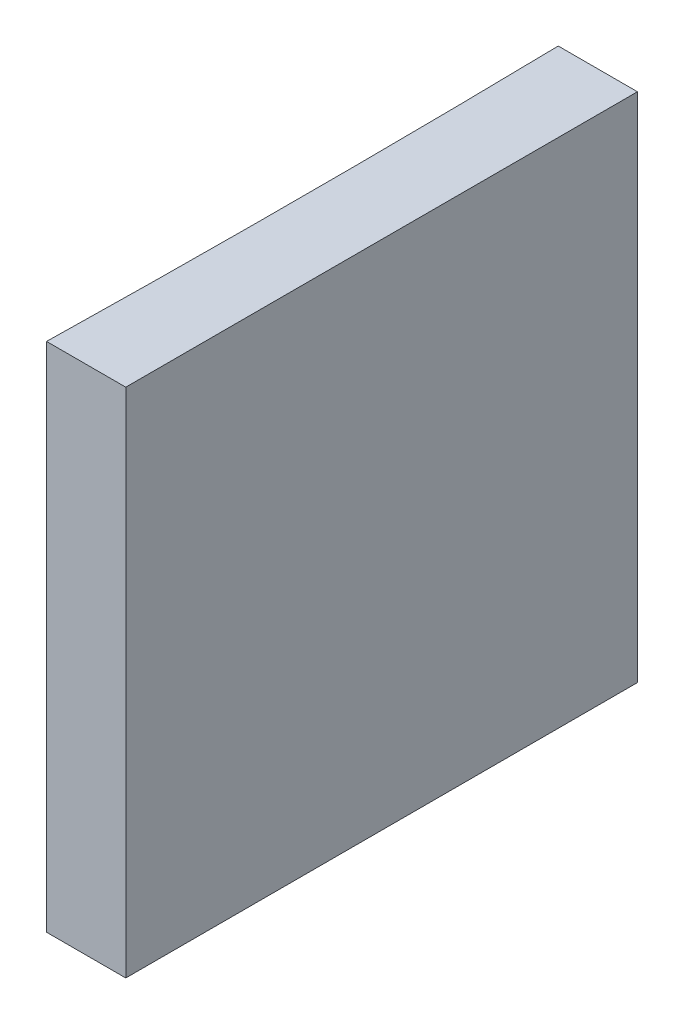
ISO-10303-21;
HEADER;
FILE_DESCRIPTION(('STEP AP214'),'2;1');
FILE_NAME('part.step','',(''),(''),'','','');
FILE_SCHEMA(('AUTOMOTIVE_DESIGN { 1 0 10303 214 1 1 1 1 }'));
ENDSEC;
DATA;
#1=APPLICATION_CONTEXT('core data for automotive mechanical design processes');
#2=APPLICATION_PROTOCOL_DEFINITION('international standard','automotive_design',2000,#1);
#3=PRODUCT_CONTEXT('',#1,'mechanical');
#4=PRODUCT('Part','Part','',(#3));
#5=PRODUCT_RELATED_PRODUCT_CATEGORY('part','',(#4));
#6=PRODUCT_DEFINITION_FORMATION('','',#4);
#7=PRODUCT_DEFINITION_CONTEXT('part definition',#1,'design');
#8=PRODUCT_DEFINITION('design','',#6,#7);
#9=PRODUCT_DEFINITION_SHAPE('','',#8);
#10=(LENGTH_UNIT() NAMED_UNIT(*) SI_UNIT(.MILLI.,.METRE.));
#11=(NAMED_UNIT(*) PLANE_ANGLE_UNIT() SI_UNIT($,.RADIAN.));
#12=(NAMED_UNIT(*) SI_UNIT($,.STERADIAN.) SOLID_ANGLE_UNIT());
#13=UNCERTAINTY_MEASURE_WITH_UNIT(LENGTH_MEASURE(1.E-05),#10,'distance_accuracy_value','');
#14=(GEOMETRIC_REPRESENTATION_CONTEXT(3) GLOBAL_UNCERTAINTY_ASSIGNED_CONTEXT((#13)) GLOBAL_UNIT_ASSIGNED_CONTEXT((#10,
#11,#12)) REPRESENTATION_CONTEXT('',''));
#15=CARTESIAN_POINT('',(0.,0.,0.));
#16=DIRECTION('',(0.,0.,1.));
#17=DIRECTION('',(1.,0.,0.));
#18=AXIS2_PLACEMENT_3D('',#15,#16,#17);
#19=CARTESIAN_POINT('',(0.,20.,0.));
#20=DIRECTION('',(0.,0.,1.));
#21=DIRECTION('',(1.,0.,0.));
#22=AXIS2_PLACEMENT_3D('',#19,#20,#21);
#23=PLANE('',#22);
#24=DIRECTION('',(-1.,0.,0.));
#25=VECTOR('',#24,1.);
#26=CARTESIAN_POINT('',(0.,0.,0.));
#27=LINE('',#26,#25);
#28=CARTESIAN_POINT('',(0.,0.,0.));
#29=VERTEX_POINT('',#28);
#30=CARTESIAN_POINT('',(-3.09675828382883,0.,0.));
#31=VERTEX_POINT('',#30);
#32=EDGE_CURVE('E100',#29,#31,#27,.T.);
#33=ORIENTED_EDGE('',*,*,#32,.T.);
#34=DIRECTION('',(0.,-1.,0.));
#35=VECTOR('',#34,1.);
#36=CARTESIAN_POINT('',(-3.09675828382883,20.,0.));
#37=LINE('',#36,#35);
#38=CARTESIAN_POINT('',(-3.09675828382883,20.,0.));
#39=VERTEX_POINT('',#38);
#40=EDGE_CURVE('E11',#39,#31,#37,.T.);
#41=ORIENTED_EDGE('',*,*,#40,.F.);
#42=DIRECTION('',(-1.,0.,0.));
#43=VECTOR('',#42,1.);
#44=CARTESIAN_POINT('',(0.,20.,0.));
#45=LINE('',#44,#43);
#46=CARTESIAN_POINT('',(0.,20.,0.));
#47=VERTEX_POINT('',#46);
#48=EDGE_CURVE('E88',#47,#39,#45,.T.);
#49=ORIENTED_EDGE('',*,*,#48,.F.);
#50=DIRECTION('',(0.,-1.,0.));
#51=VECTOR('',#50,1.);
#52=CARTESIAN_POINT('',(0.,20.,0.));
#53=LINE('',#52,#51);
#54=EDGE_CURVE('E96',#47,#29,#53,.T.);
#55=ORIENTED_EDGE('',*,*,#54,.T.);
#56=EDGE_LOOP('',(#33,#41,#49,#55));
#57=FACE_BOUND('',#56,.T.);
#58=ADVANCED_FACE('F37',(#57),#23,.F.);
#59=CARTESIAN_POINT('',(-519.8,20.,10.0000000000001));
#60=DIRECTION('',(0.,-1.,0.));
#61=DIRECTION('',(0.,0.,-1.));
#62=AXIS2_PLACEMENT_3D('',#59,#60,#61);
#63=CYLINDRICAL_SURFACE('',#62,516.8);
#64=CARTESIAN_POINT('',(-519.8,0.,10.0000000000001));
#65=DIRECTION('',(0.,-1.,0.));
#66=DIRECTION('',(0.,0.,1.));
#67=AXIS2_PLACEMENT_3D('',#64,#65,#66);
#68=CIRCLE('',#67,516.8);
#69=CARTESIAN_POINT('',(-3.09675828382884,0.,20.));
#70=VERTEX_POINT('',#69);
#71=EDGE_CURVE('E92',#31,#70,#68,.T.);
#72=ORIENTED_EDGE('',*,*,#71,.T.);
#73=DIRECTION('',(0.,-1.,0.));
#74=VECTOR('',#73,1.);
#75=CARTESIAN_POINT('',(-3.09675828382884,20.,20.));
#76=LINE('',#75,#74);
#77=CARTESIAN_POINT('',(-3.09675828382884,20.,20.));
#78=VERTEX_POINT('',#77);
#79=EDGE_CURVE('E45',#78,#70,#76,.T.);
#80=ORIENTED_EDGE('',*,*,#79,.F.);
#81=CARTESIAN_POINT('',(-519.8,20.,10.0000000000001));
#82=DIRECTION('',(0.,-1.,0.));
#83=DIRECTION('',(0.,0.,1.));
#84=AXIS2_PLACEMENT_3D('',#81,#82,#83);
#85=CIRCLE('',#84,516.8);
#86=EDGE_CURVE('E83',#39,#78,#85,.T.);
#87=ORIENTED_EDGE('',*,*,#86,.F.);
#88=ORIENTED_EDGE('',*,*,#40,.T.);
#89=EDGE_LOOP('',(#72,#80,#87,#88));
#90=FACE_BOUND('',#89,.T.);
#91=ADVANCED_FACE('F91',(#90),#63,.F.);
#92=CARTESIAN_POINT('',(0.,20.,20.));
#93=DIRECTION('',(0.,0.,-1.));
#94=DIRECTION('',(-1.,0.,0.));
#95=AXIS2_PLACEMENT_3D('',#92,#93,#94);
#96=PLANE('',#95);
#97=DIRECTION('',(1.,0.,0.));
#98=VECTOR('',#97,1.);
#99=CARTESIAN_POINT('',(0.,0.,20.));
#100=LINE('',#99,#98);
#101=CARTESIAN_POINT('',(0.,0.,20.));
#102=VERTEX_POINT('',#101);
#103=EDGE_CURVE('E70',#70,#102,#100,.T.);
#104=ORIENTED_EDGE('',*,*,#103,.T.);
#105=DIRECTION('',(0.,-1.,0.));
#106=VECTOR('',#105,1.);
#107=CARTESIAN_POINT('',(0.,20.,20.));
#108=LINE('',#107,#106);
#109=CARTESIAN_POINT('',(0.,20.,20.));
#110=VERTEX_POINT('',#109);
#111=EDGE_CURVE('E93',#110,#102,#108,.T.);
#112=ORIENTED_EDGE('',*,*,#111,.F.);
#113=DIRECTION('',(1.,0.,0.));
#114=VECTOR('',#113,1.);
#115=CARTESIAN_POINT('',(0.,20.,20.));
#116=LINE('',#115,#114);
#117=EDGE_CURVE('E86',#78,#110,#116,.T.);
#118=ORIENTED_EDGE('',*,*,#117,.F.);
#119=ORIENTED_EDGE('',*,*,#79,.T.);
#120=EDGE_LOOP('',(#104,#112,#118,#119));
#121=FACE_BOUND('',#120,.T.);
#122=ADVANCED_FACE('F94',(#121),#96,.F.);
#123=CARTESIAN_POINT('',(0.,20.,0.));
#124=DIRECTION('',(-1.,0.,0.));
#125=DIRECTION('',(0.,0.,1.));
#126=AXIS2_PLACEMENT_3D('',#123,#124,#125);
#127=PLANE('',#126);
#128=DIRECTION('',(0.,0.,-1.));
#129=VECTOR('',#128,1.);
#130=CARTESIAN_POINT('',(0.,0.,0.));
#131=LINE('',#130,#129);
#132=EDGE_CURVE('E76',#102,#29,#131,.T.);
#133=ORIENTED_EDGE('',*,*,#132,.T.);
#134=ORIENTED_EDGE('',*,*,#54,.F.);
#135=DIRECTION('',(0.,0.,-1.));
#136=VECTOR('',#135,1.);
#137=CARTESIAN_POINT('',(0.,20.,0.));
#138=LINE('',#137,#136);
#139=EDGE_CURVE('E53',#110,#47,#138,.T.);
#140=ORIENTED_EDGE('',*,*,#139,.F.);
#141=ORIENTED_EDGE('',*,*,#111,.T.);
#142=EDGE_LOOP('',(#133,#134,#140,#141));
#143=FACE_BOUND('',#142,.T.);
#144=ADVANCED_FACE('F107',(#143),#127,.F.);
#145=CARTESIAN_POINT('',(-519.8,20.,10.0000000000001));
#146=DIRECTION('',(0.,1.,0.));
#147=DIRECTION('',(0.,0.,1.));
#148=AXIS2_PLACEMENT_3D('',#145,#146,#147);
#149=PLANE('',#148);
#150=ORIENTED_EDGE('',*,*,#48,.T.);
#151=ORIENTED_EDGE('',*,*,#86,.T.);
#152=ORIENTED_EDGE('',*,*,#117,.T.);
#153=ORIENTED_EDGE('',*,*,#139,.T.);
#154=EDGE_LOOP('',(#150,#151,#152,#153));
#155=FACE_BOUND('',#154,.T.);
#156=ADVANCED_FACE('F84',(#155),#149,.T.);
#157=CARTESIAN_POINT('',(-519.8,0.,10.0000000000001));
#158=DIRECTION('',(0.,1.,0.));
#159=DIRECTION('',(0.,0.,1.));
#160=AXIS2_PLACEMENT_3D('',#157,#158,#159);
#161=PLANE('',#160);
#162=ORIENTED_EDGE('',*,*,#32,.F.);
#163=ORIENTED_EDGE('',*,*,#132,.F.);
#164=ORIENTED_EDGE('',*,*,#103,.F.);
#165=ORIENTED_EDGE('',*,*,#71,.F.);
#166=EDGE_LOOP('',(#162,#163,#164,#165));
#167=FACE_BOUND('',#166,.T.);
#168=ADVANCED_FACE('F110',(#167),#161,.F.);
#169=CLOSED_SHELL('',(#58,#91,#122,#144,#156,#168));
#170=MANIFOLD_SOLID_BREP('B2',#169);
#171=ADVANCED_BREP_SHAPE_REPRESENTATION('',(#18,#170),#14);
#172=SHAPE_DEFINITION_REPRESENTATION(#9,#171);
ENDSEC;
END-ISO-10303-21;
